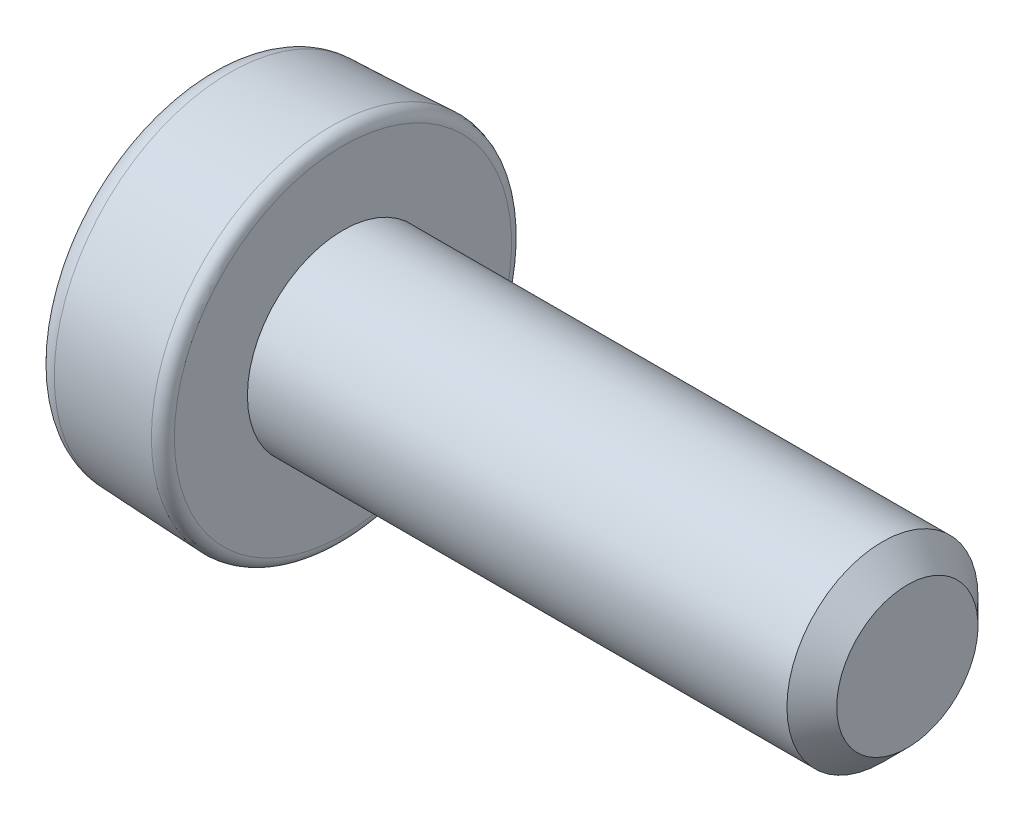
ISO-10303-21;
HEADER;
FILE_DESCRIPTION(('STEP AP214'),'2;1');
FILE_NAME('part.step','',(''),(''),'','','');
FILE_SCHEMA(('AUTOMOTIVE_DESIGN { 1 0 10303 214 1 1 1 1 }'));
ENDSEC;
DATA;
#1=APPLICATION_CONTEXT('core data for automotive mechanical design processes');
#2=APPLICATION_PROTOCOL_DEFINITION('international standard','automotive_design',2000,#1);
#3=PRODUCT_CONTEXT('',#1,'mechanical');
#4=PRODUCT('Part','Part','',(#3));
#5=PRODUCT_RELATED_PRODUCT_CATEGORY('part','',(#4));
#6=PRODUCT_DEFINITION_FORMATION('','',#4);
#7=PRODUCT_DEFINITION_CONTEXT('part definition',#1,'design');
#8=PRODUCT_DEFINITION('design','',#6,#7);
#9=PRODUCT_DEFINITION_SHAPE('','',#8);
#10=(LENGTH_UNIT() NAMED_UNIT(*) SI_UNIT(.MILLI.,.METRE.));
#11=(NAMED_UNIT(*) PLANE_ANGLE_UNIT() SI_UNIT($,.RADIAN.));
#12=(NAMED_UNIT(*) SI_UNIT($,.STERADIAN.) SOLID_ANGLE_UNIT());
#13=UNCERTAINTY_MEASURE_WITH_UNIT(LENGTH_MEASURE(1.E-05),#10,'distance_accuracy_value','');
#14=(GEOMETRIC_REPRESENTATION_CONTEXT(3) GLOBAL_UNCERTAINTY_ASSIGNED_CONTEXT((#13)) GLOBAL_UNIT_ASSIGNED_CONTEXT((#10,
#11,#12)) REPRESENTATION_CONTEXT('',''));
#15=CARTESIAN_POINT('',(0.,0.,0.));
#16=DIRECTION('',(0.,0.,1.));
#17=DIRECTION('',(1.,0.,0.));
#18=AXIS2_PLACEMENT_3D('',#15,#16,#17);
#19=CARTESIAN_POINT('',(-1.2,1.35943108259077,0.));
#20=DIRECTION('',(1.,0.,0.));
#21=DIRECTION('',(0.,0.,-1.));
#22=AXIS2_PLACEMENT_3D('',#19,#20,#21);
#23=PLANE('',#22);
#24=DIRECTION('',(0.,0.,-1.));
#25=VECTOR('',#24,1.);
#26=CARTESIAN_POINT('',(-1.2,0.15,0.));
#27=LINE('',#26,#25);
#28=CARTESIAN_POINT('',(-1.2,0.149999999999999,-0.35));
#29=VERTEX_POINT('',#28);
#30=CARTESIAN_POINT('',(-1.2,0.149999999999997,-0.8));
#31=VERTEX_POINT('',#30);
#32=EDGE_CURVE('E203',#29,#31,#27,.T.);
#33=ORIENTED_EDGE('',*,*,#32,.F.);
#34=DIRECTION('',(0.,-0.707106781186551,-0.707106781186544));
#35=VECTOR('',#34,1.);
#36=CARTESIAN_POINT('',(-1.2,0.35,-0.15));
#37=LINE('',#36,#35);
#38=CARTESIAN_POINT('',(-1.2,0.35,-0.15));
#39=VERTEX_POINT('',#38);
#40=EDGE_CURVE('E266',#29,#39,#37,.F.);
#41=ORIENTED_EDGE('',*,*,#40,.T.);
#42=DIRECTION('',(0.,-1.,0.));
#43=VECTOR('',#42,1.);
#44=CARTESIAN_POINT('',(-1.2,0.,-0.15));
#45=LINE('',#44,#43);
#46=CARTESIAN_POINT('',(-1.2,0.8,-0.15));
#47=VERTEX_POINT('',#46);
#48=EDGE_CURVE('E211',#47,#39,#45,.T.);
#49=ORIENTED_EDGE('',*,*,#48,.F.);
#50=DIRECTION('',(0.,0.,-1.));
#51=VECTOR('',#50,1.);
#52=CARTESIAN_POINT('',(-1.2,0.8,-0.15));
#53=LINE('',#52,#51);
#54=CARTESIAN_POINT('',(-1.2,0.8,0.15));
#55=VERTEX_POINT('',#54);
#56=EDGE_CURVE('E218',#55,#47,#53,.T.);
#57=ORIENTED_EDGE('',*,*,#56,.F.);
#58=DIRECTION('',(0.,1.,0.));
#59=VECTOR('',#58,1.);
#60=CARTESIAN_POINT('',(-1.2,0.,0.15));
#61=LINE('',#60,#59);
#62=CARTESIAN_POINT('',(-1.2,0.349999999999999,0.15));
#63=VERTEX_POINT('',#62);
#64=EDGE_CURVE('E226',#63,#55,#61,.T.);
#65=ORIENTED_EDGE('',*,*,#64,.F.);
#66=DIRECTION('',(0.,0.707106781186543,-0.707106781186552));
#67=VECTOR('',#66,1.);
#68=CARTESIAN_POINT('',(-1.2,0.349999999999999,0.15));
#69=LINE('',#68,#67);
#70=CARTESIAN_POINT('',(-1.2,0.150000000000001,0.35));
#71=VERTEX_POINT('',#70);
#72=EDGE_CURVE('E262',#63,#71,#69,.F.);
#73=ORIENTED_EDGE('',*,*,#72,.T.);
#74=CARTESIAN_POINT('',(-1.2,0.150000000000008,0.799999999999998));
#75=VERTEX_POINT('',#74);
#76=EDGE_CURVE('E204',#75,#71,#27,.T.);
#77=ORIENTED_EDGE('',*,*,#76,.F.);
#78=DIRECTION('',(0.,1.,0.));
#79=VECTOR('',#78,1.);
#80=CARTESIAN_POINT('',(-1.2,0.150000000000008,0.799999999999998));
#81=LINE('',#80,#79);
#82=CARTESIAN_POINT('',(-1.2,-0.149999999999992,0.800000000000001));
#83=VERTEX_POINT('',#82);
#84=EDGE_CURVE('E150',#83,#75,#81,.T.);
#85=ORIENTED_EDGE('',*,*,#84,.F.);
#86=DIRECTION('',(0.,0.,1.));
#87=VECTOR('',#86,1.);
#88=CARTESIAN_POINT('',(-1.2,-0.15,0.));
#89=LINE('',#88,#87);
#90=CARTESIAN_POINT('',(-1.2,-0.149999999999996,0.350000000000003));
#91=VERTEX_POINT('',#90);
#92=EDGE_CURVE('E156',#91,#83,#89,.T.);
#93=ORIENTED_EDGE('',*,*,#92,.F.);
#94=DIRECTION('',(0.,0.707106781186554,0.707106781186541));
#95=VECTOR('',#94,1.);
#96=CARTESIAN_POINT('',(-1.2,-0.35,0.150000000000002));
#97=LINE('',#96,#95);
#98=CARTESIAN_POINT('',(-1.2,-0.35,0.150000000000002));
#99=VERTEX_POINT('',#98);
#100=EDGE_CURVE('E260',#91,#99,#97,.F.);
#101=ORIENTED_EDGE('',*,*,#100,.T.);
#102=DIRECTION('',(0.,1.,0.));
#103=VECTOR('',#102,1.);
#104=CARTESIAN_POINT('',(-1.2,0.,0.15));
#105=LINE('',#104,#103);
#106=CARTESIAN_POINT('',(-1.2,-0.799999999999999,0.150000000000006));
#107=VERTEX_POINT('',#106);
#108=EDGE_CURVE('E168',#107,#99,#105,.T.);
#109=ORIENTED_EDGE('',*,*,#108,.F.);
#110=DIRECTION('',(0.,0.,1.));
#111=VECTOR('',#110,1.);
#112=CARTESIAN_POINT('',(-1.2,-0.799999999999999,0.150000000000006));
#113=LINE('',#112,#111);
#114=CARTESIAN_POINT('',(-1.2,-0.800000000000001,-0.149999999999994));
#115=VERTEX_POINT('',#114);
#116=EDGE_CURVE('E173',#115,#107,#113,.T.);
#117=ORIENTED_EDGE('',*,*,#116,.F.);
#118=DIRECTION('',(0.,-1.,0.));
#119=VECTOR('',#118,1.);
#120=CARTESIAN_POINT('',(-1.2,0.,-0.15));
#121=LINE('',#120,#119);
#122=CARTESIAN_POINT('',(-1.2,-0.350000000000002,-0.149999999999998));
#123=VERTEX_POINT('',#122);
#124=EDGE_CURVE('E181',#123,#115,#121,.T.);
#125=ORIENTED_EDGE('',*,*,#124,.F.);
#126=DIRECTION('',(0.,-0.707106781186545,0.70710678118655));
#127=VECTOR('',#126,1.);
#128=CARTESIAN_POINT('',(-1.2,-0.150000000000001,-0.35));
#129=LINE('',#128,#127);
#130=CARTESIAN_POINT('',(-1.2,-0.150000000000001,-0.35));
#131=VERTEX_POINT('',#130);
#132=EDGE_CURVE('E264',#123,#131,#129,.F.);
#133=ORIENTED_EDGE('',*,*,#132,.T.);
#134=DIRECTION('',(0.,0.,1.));
#135=VECTOR('',#134,1.);
#136=CARTESIAN_POINT('',(-1.2,-0.15,0.));
#137=LINE('',#136,#135);
#138=CARTESIAN_POINT('',(-1.2,-0.150000000000003,-0.799999999999999));
#139=VERTEX_POINT('',#138);
#140=EDGE_CURVE('E187',#139,#131,#137,.T.);
#141=ORIENTED_EDGE('',*,*,#140,.F.);
#142=DIRECTION('',(0.,-1.,0.));
#143=VECTOR('',#142,1.);
#144=CARTESIAN_POINT('',(-1.2,-0.150000000000003,-0.799999999999999));
#145=LINE('',#144,#143);
#146=EDGE_CURVE('E194',#31,#139,#145,.T.);
#147=ORIENTED_EDGE('',*,*,#146,.F.);
#148=EDGE_LOOP('',(#33,#41,#49,#57,#65,#73,#77,#85,#93,#101,#109,#117,#125,#133,#141,#147));
#149=FACE_BOUND('',#148,.T.);
#150=CARTESIAN_POINT('',(-1.2,0.,0.));
#151=DIRECTION('',(-1.,0.,0.));
#152=DIRECTION('',(0.,0.,1.));
#153=AXIS2_PLACEMENT_3D('',#150,#151,#152);
#154=CIRCLE('',#153,1.35943108259077);
#155=CARTESIAN_POINT('',(-1.2,0.,1.35943108259077));
#156=VERTEX_POINT('',#155);
#157=EDGE_CURVE('E252',#156,#156,#154,.T.);
#158=ORIENTED_EDGE('',*,*,#157,.T.);
#159=EDGE_LOOP('',(#158));
#160=FACE_BOUND('',#159,.T.);
#161=ADVANCED_FACE('F34',(#149,#160),#23,.F.);
#162=CARTESIAN_POINT('',(-1.,0.,0.));
#163=DIRECTION('',(-1.,0.,0.));
#164=DIRECTION('',(0.,0.,1.));
#165=AXIS2_PLACEMENT_3D('',#162,#163,#164);
#166=TOROIDAL_SURFACE('',#165,1.35943108259077,0.2);
#167=ORIENTED_EDGE('',*,*,#157,.F.);
#168=EDGE_LOOP('',(#167));
#169=FACE_BOUND('',#168,.T.);
#170=CARTESIAN_POINT('',(-1.00900614699517,0.,0.));
#171=DIRECTION('',(-1.,0.,0.));
#172=DIRECTION('',(0.,0.,1.));
#173=AXIS2_PLACEMENT_3D('',#170,#171,#172);
#174=CIRCLE('',#173,1.55922820298118);
#175=CARTESIAN_POINT('',(-1.00900614699517,0.,1.55922820298118));
#176=VERTEX_POINT('',#175);
#177=EDGE_CURVE('E249',#176,#176,#174,.T.);
#178=ORIENTED_EDGE('',*,*,#177,.T.);
#179=EDGE_LOOP('',(#178));
#180=FACE_BOUND('',#179,.T.);
#181=ADVANCED_FACE('F354',(#169,#180),#166,.T.);
#182=CARTESIAN_POINT('',(-0.104503073497586,0.,0.));
#183=DIRECTION('',(1.,0.,0.));
#184=DIRECTION('',(0.,0.,-1.));
#185=AXIS2_PLACEMENT_3D('',#182,#183,#184);
#186=CONICAL_SURFACE('',#185,1.6,0.0450459675199961);
#187=ORIENTED_EDGE('',*,*,#177,.F.);
#188=EDGE_LOOP('',(#187));
#189=FACE_BOUND('',#188,.T.);
#190=CARTESIAN_POINT('',(-0.104503073497586,0.,0.));
#191=DIRECTION('',(-1.,0.,0.));
#192=DIRECTION('',(0.,0.,1.));
#193=AXIS2_PLACEMENT_3D('',#190,#191,#192);
#194=CIRCLE('',#193,1.6);
#195=CARTESIAN_POINT('',(-0.104503073497586,0.,1.6));
#196=VERTEX_POINT('',#195);
#197=EDGE_CURVE('E246',#196,#196,#194,.T.);
#198=ORIENTED_EDGE('',*,*,#197,.T.);
#199=EDGE_LOOP('',(#198));
#200=FACE_BOUND('',#199,.T.);
#201=ADVANCED_FACE('F359',(#189,#200),#186,.T.);
#202=CARTESIAN_POINT('',(-0.1,0.,0.));
#203=DIRECTION('',(-1.,0.,0.));
#204=DIRECTION('',(0.,0.,1.));
#205=AXIS2_PLACEMENT_3D('',#202,#203,#204);
#206=TOROIDAL_SURFACE('',#205,1.50010143980479,0.1);
#207=ORIENTED_EDGE('',*,*,#197,.F.);
#208=EDGE_LOOP('',(#207));
#209=FACE_BOUND('',#208,.T.);
#210=CARTESIAN_POINT('',(0.,0.,0.));
#211=DIRECTION('',(-1.,0.,0.));
#212=DIRECTION('',(0.,0.,1.));
#213=AXIS2_PLACEMENT_3D('',#210,#211,#212);
#214=CIRCLE('',#213,1.50010143980479);
#215=CARTESIAN_POINT('',(0.,0.,1.50010143980479));
#216=VERTEX_POINT('',#215);
#217=EDGE_CURVE('E243',#216,#216,#214,.T.);
#218=ORIENTED_EDGE('',*,*,#217,.T.);
#219=EDGE_LOOP('',(#218));
#220=FACE_BOUND('',#219,.T.);
#221=ADVANCED_FACE('F532',(#209,#220),#206,.T.);
#222=CARTESIAN_POINT('',(0.,0.849999999999999,0.));
#223=DIRECTION('',(-1.,0.,0.));
#224=DIRECTION('',(0.,0.,1.));
#225=AXIS2_PLACEMENT_3D('',#222,#223,#224);
#226=PLANE('',#225);
#227=ORIENTED_EDGE('',*,*,#217,.F.);
#228=EDGE_LOOP('',(#227));
#229=FACE_BOUND('',#228,.T.);
#230=CARTESIAN_POINT('',(0.,0.,0.));
#231=DIRECTION('',(-1.,0.,0.));
#232=DIRECTION('',(0.,0.,1.));
#233=AXIS2_PLACEMENT_3D('',#230,#231,#232);
#234=CIRCLE('',#233,0.849999999999999);
#235=CARTESIAN_POINT('',(0.,0.,0.849999999999999));
#236=VERTEX_POINT('',#235);
#237=EDGE_CURVE('E240',#236,#236,#234,.T.);
#238=ORIENTED_EDGE('',*,*,#237,.T.);
#239=EDGE_LOOP('',(#238));
#240=FACE_BOUND('',#239,.T.);
#241=ADVANCED_FACE('F522',(#229,#240),#226,.F.);
#242=CARTESIAN_POINT('',(-2.78391866276236,0.,0.));
#243=DIRECTION('',(-1.,0.,0.));
#244=DIRECTION('',(0.,0.,1.));
#245=AXIS2_PLACEMENT_3D('',#242,#243,#244);
#246=CYLINDRICAL_SURFACE('',#245,0.85);
#247=ORIENTED_EDGE('',*,*,#237,.F.);
#248=EDGE_LOOP('',(#247));
#249=FACE_BOUND('',#248,.T.);
#250=CARTESIAN_POINT('',(4.8,0.,0.));
#251=DIRECTION('',(-1.,0.,0.));
#252=DIRECTION('',(0.,0.,1.));
#253=AXIS2_PLACEMENT_3D('',#250,#251,#252);
#254=CIRCLE('',#253,0.85);
#255=CARTESIAN_POINT('',(4.8,0.,0.85));
#256=VERTEX_POINT('',#255);
#257=EDGE_CURVE('E237',#256,#256,#254,.T.);
#258=ORIENTED_EDGE('',*,*,#257,.T.);
#259=EDGE_LOOP('',(#258));
#260=FACE_BOUND('',#259,.T.);
#261=ADVANCED_FACE('F512',(#249,#260),#246,.T.);
#262=CARTESIAN_POINT('',(5.02160747377912,0.,0.));
#263=DIRECTION('',(-1.,0.,0.));
#264=DIRECTION('',(0.,0.,1.));
#265=AXIS2_PLACEMENT_3D('',#262,#263,#264);
#266=CONICAL_SURFACE('',#265,0.628392526220876,0.785398163397451);
#267=ORIENTED_EDGE('',*,*,#257,.F.);
#268=EDGE_LOOP('',(#267));
#269=FACE_BOUND('',#268,.T.);
#270=CARTESIAN_POINT('',(5.02160747377912,0.,0.));
#271=DIRECTION('',(-1.,0.,0.));
#272=DIRECTION('',(0.,0.,1.));
#273=AXIS2_PLACEMENT_3D('',#270,#271,#272);
#274=CIRCLE('',#273,0.628392526220876);
#275=CARTESIAN_POINT('',(5.02160747377912,0.,0.628392526220876));
#276=VERTEX_POINT('',#275);
#277=EDGE_CURVE('E232',#276,#276,#274,.T.);
#278=ORIENTED_EDGE('',*,*,#277,.T.);
#279=EDGE_LOOP('',(#278));
#280=FACE_BOUND('',#279,.T.);
#281=ADVANCED_FACE('F502',(#269,#280),#266,.T.);
#282=CARTESIAN_POINT('',(5.02160747377912,0.,0.));
#283=DIRECTION('',(-1.,0.,0.));
#284=DIRECTION('',(0.,0.,1.));
#285=AXIS2_PLACEMENT_3D('',#282,#283,#284);
#286=PLANE('',#285);
#287=ORIENTED_EDGE('',*,*,#277,.F.);
#288=EDGE_LOOP('',(#287));
#289=FACE_BOUND('',#288,.T.);
#290=ADVANCED_FACE('F350',(#289),#286,.F.);
#291=CARTESIAN_POINT('',(-0.9,0.,-0.15));
#292=DIRECTION('',(0.,0.,-1.));
#293=DIRECTION('',(-1.,0.,0.));
#294=AXIS2_PLACEMENT_3D('',#291,#292,#293);
#295=PLANE('',#294);
#296=ORIENTED_EDGE('',*,*,#48,.T.);
#297=DIRECTION('',(1.,0.,0.));
#298=VECTOR('',#297,1.);
#299=CARTESIAN_POINT('',(-0.9,0.35,-0.15));
#300=LINE('',#299,#298);
#301=CARTESIAN_POINT('',(-0.9,0.35,-0.15));
#302=VERTEX_POINT('',#301);
#303=EDGE_CURVE('E255',#39,#302,#300,.T.);
#304=ORIENTED_EDGE('',*,*,#303,.T.);
#305=DIRECTION('',(0.,-1.,0.));
#306=VECTOR('',#305,1.);
#307=CARTESIAN_POINT('',(-0.9,0.,-0.15));
#308=LINE('',#307,#306);
#309=CARTESIAN_POINT('',(-0.9,0.8,-0.15));
#310=VERTEX_POINT('',#309);
#311=EDGE_CURVE('E214',#310,#302,#308,.T.);
#312=ORIENTED_EDGE('',*,*,#311,.F.);
#313=DIRECTION('',(-1.,0.,0.));
#314=VECTOR('',#313,1.);
#315=CARTESIAN_POINT('',(-0.9,0.8,-0.15));
#316=LINE('',#315,#314);
#317=EDGE_CURVE('E230',#310,#47,#316,.T.);
#318=ORIENTED_EDGE('',*,*,#317,.T.);
#319=EDGE_LOOP('',(#296,#304,#312,#318));
#320=FACE_BOUND('',#319,.T.);
#321=ADVANCED_FACE('F340',(#320),#295,.F.);
#322=CARTESIAN_POINT('',(-0.9,0.8,-0.15));
#323=DIRECTION('',(0.,1.,0.));
#324=DIRECTION('',(0.,0.,1.));
#325=AXIS2_PLACEMENT_3D('',#322,#323,#324);
#326=PLANE('',#325);
#327=ORIENTED_EDGE('',*,*,#56,.T.);
#328=ORIENTED_EDGE('',*,*,#317,.F.);
#329=DIRECTION('',(0.,0.,-1.));
#330=VECTOR('',#329,1.);
#331=CARTESIAN_POINT('',(-0.9,0.8,-0.15));
#332=LINE('',#331,#330);
#333=CARTESIAN_POINT('',(-0.9,0.8,0.15));
#334=VERTEX_POINT('',#333);
#335=EDGE_CURVE('E220',#334,#310,#332,.T.);
#336=ORIENTED_EDGE('',*,*,#335,.F.);
#337=DIRECTION('',(-1.,0.,0.));
#338=VECTOR('',#337,1.);
#339=CARTESIAN_POINT('',(-0.9,0.8,0.15));
#340=LINE('',#339,#338);
#341=EDGE_CURVE('E223',#334,#55,#340,.T.);
#342=ORIENTED_EDGE('',*,*,#341,.T.);
#343=EDGE_LOOP('',(#327,#328,#336,#342));
#344=FACE_BOUND('',#343,.T.);
#345=ADVANCED_FACE('F342',(#344),#326,.F.);
#346=CARTESIAN_POINT('',(-0.9,0.,0.15));
#347=DIRECTION('',(0.,0.,1.));
#348=DIRECTION('',(0.,-1.,0.));
#349=AXIS2_PLACEMENT_3D('',#346,#347,#348);
#350=PLANE('',#349);
#351=DIRECTION('',(0.,1.,0.));
#352=VECTOR('',#351,1.);
#353=CARTESIAN_POINT('',(-0.9,0.,0.15));
#354=LINE('',#353,#352);
#355=CARTESIAN_POINT('',(-0.9,0.349999999999999,0.15));
#356=VERTEX_POINT('',#355);
#357=EDGE_CURVE('E217',#356,#334,#354,.T.);
#358=ORIENTED_EDGE('',*,*,#357,.F.);
#359=DIRECTION('',(-1.,0.,0.));
#360=VECTOR('',#359,1.);
#361=CARTESIAN_POINT('',(-0.9,0.349999999999999,0.15));
#362=LINE('',#361,#360);
#363=EDGE_CURVE('E273',#356,#63,#362,.T.);
#364=ORIENTED_EDGE('',*,*,#363,.T.);
#365=ORIENTED_EDGE('',*,*,#64,.T.);
#366=ORIENTED_EDGE('',*,*,#341,.F.);
#367=EDGE_LOOP('',(#358,#364,#365,#366));
#368=FACE_BOUND('',#367,.T.);
#369=ADVANCED_FACE('F292',(#368),#350,.F.);
#370=CARTESIAN_POINT('',(-0.9,0.8,-0.15));
#371=DIRECTION('',(1.,0.,0.));
#372=DIRECTION('',(0.,0.,-1.));
#373=AXIS2_PLACEMENT_3D('',#370,#371,#372);
#374=PLANE('',#373);
#375=DIRECTION('',(0.,0.,-1.));
#376=VECTOR('',#375,1.);
#377=CARTESIAN_POINT('',(-0.9,0.15,0.));
#378=LINE('',#377,#376);
#379=CARTESIAN_POINT('',(-0.9,0.150000000000008,0.799999999999998));
#380=VERTEX_POINT('',#379);
#381=CARTESIAN_POINT('',(-0.9,0.150000000000001,0.35));
#382=VERTEX_POINT('',#381);
#383=EDGE_CURVE('E195',#380,#382,#378,.T.);
#384=ORIENTED_EDGE('',*,*,#383,.T.);
#385=DIRECTION('',(0.,-0.707106781186543,0.707106781186552));
#386=VECTOR('',#385,1.);
#387=CARTESIAN_POINT('',(-0.9,0.724999999999997,-0.225000000000002));
#388=LINE('',#387,#386);
#389=EDGE_CURVE('E42',#382,#356,#388,.F.);
#390=ORIENTED_EDGE('',*,*,#389,.T.);
#391=ORIENTED_EDGE('',*,*,#357,.T.);
#392=ORIENTED_EDGE('',*,*,#335,.T.);
#393=ORIENTED_EDGE('',*,*,#311,.T.);
#394=DIRECTION('',(0.,0.707106781186551,0.707106781186544));
#395=VECTOR('',#394,1.);
#396=CARTESIAN_POINT('',(-0.9,0.575000000000002,0.0749999999999999));
#397=LINE('',#396,#395);
#398=CARTESIAN_POINT('',(-0.9,0.149999999999999,-0.35));
#399=VERTEX_POINT('',#398);
#400=EDGE_CURVE('E282',#302,#399,#397,.F.);
#401=ORIENTED_EDGE('',*,*,#400,.T.);
#402=CARTESIAN_POINT('',(-0.9,0.149999999999997,-0.8));
#403=VERTEX_POINT('',#402);
#404=EDGE_CURVE('E193',#399,#403,#378,.T.);
#405=ORIENTED_EDGE('',*,*,#404,.T.);
#406=DIRECTION('',(0.,-1.,0.));
#407=VECTOR('',#406,1.);
#408=CARTESIAN_POINT('',(-0.9,-0.150000000000003,-0.799999999999999));
#409=LINE('',#408,#407);
#410=CARTESIAN_POINT('',(-0.9,-0.150000000000003,-0.799999999999999));
#411=VERTEX_POINT('',#410);
#412=EDGE_CURVE('E197',#403,#411,#409,.T.);
#413=ORIENTED_EDGE('',*,*,#412,.T.);
#414=DIRECTION('',(0.,0.,1.));
#415=VECTOR('',#414,1.);
#416=CARTESIAN_POINT('',(-0.9,-0.15,0.));
#417=LINE('',#416,#415);
#418=CARTESIAN_POINT('',(-0.9,-0.150000000000001,-0.35));
#419=VERTEX_POINT('',#418);
#420=EDGE_CURVE('E190',#411,#419,#417,.T.);
#421=ORIENTED_EDGE('',*,*,#420,.T.);
#422=DIRECTION('',(0.,0.707106781186545,-0.70710678118655));
#423=VECTOR('',#422,1.);
#424=CARTESIAN_POINT('',(-0.9,0.224999999999996,-0.725));
#425=LINE('',#424,#423);
#426=CARTESIAN_POINT('',(-0.9,-0.350000000000002,-0.149999999999998));
#427=VERTEX_POINT('',#426);
#428=EDGE_CURVE('E284',#419,#427,#425,.F.);
#429=ORIENTED_EDGE('',*,*,#428,.T.);
#430=DIRECTION('',(0.,-1.,0.));
#431=VECTOR('',#430,1.);
#432=CARTESIAN_POINT('',(-0.9,0.,-0.15));
#433=LINE('',#432,#431);
#434=CARTESIAN_POINT('',(-0.9,-0.800000000000001,-0.149999999999994));
#435=VERTEX_POINT('',#434);
#436=EDGE_CURVE('E172',#427,#435,#433,.T.);
#437=ORIENTED_EDGE('',*,*,#436,.T.);
#438=DIRECTION('',(0.,0.,1.));
#439=VECTOR('',#438,1.);
#440=CARTESIAN_POINT('',(-0.9,-0.799999999999999,0.150000000000006));
#441=LINE('',#440,#439);
#442=CARTESIAN_POINT('',(-0.9,-0.799999999999999,0.150000000000006));
#443=VERTEX_POINT('',#442);
#444=EDGE_CURVE('E175',#435,#443,#441,.T.);
#445=ORIENTED_EDGE('',*,*,#444,.T.);
#446=DIRECTION('',(0.,1.,0.));
#447=VECTOR('',#446,1.);
#448=CARTESIAN_POINT('',(-0.9,0.,0.15));
#449=LINE('',#448,#447);
#450=CARTESIAN_POINT('',(-0.9,-0.35,0.150000000000002));
#451=VERTEX_POINT('',#450);
#452=EDGE_CURVE('E170',#443,#451,#449,.T.);
#453=ORIENTED_EDGE('',*,*,#452,.T.);
#454=DIRECTION('',(0.,-0.707106781186554,-0.707106781186541));
#455=VECTOR('',#454,1.);
#456=CARTESIAN_POINT('',(-0.9,0.0750000000000085,0.575000000000004));
#457=LINE('',#456,#455);
#458=CARTESIAN_POINT('',(-0.9,-0.149999999999996,0.350000000000003));
#459=VERTEX_POINT('',#458);
#460=EDGE_CURVE('E11',#451,#459,#457,.F.);
#461=ORIENTED_EDGE('',*,*,#460,.T.);
#462=DIRECTION('',(0.,0.,1.));
#463=VECTOR('',#462,1.);
#464=CARTESIAN_POINT('',(-0.9,-0.15,0.));
#465=LINE('',#464,#463);
#466=CARTESIAN_POINT('',(-0.9,-0.149999999999992,0.800000000000001));
#467=VERTEX_POINT('',#466);
#468=EDGE_CURVE('E143',#459,#467,#465,.T.);
#469=ORIENTED_EDGE('',*,*,#468,.T.);
#470=DIRECTION('',(0.,1.,0.));
#471=VECTOR('',#470,1.);
#472=CARTESIAN_POINT('',(-0.9,0.150000000000008,0.799999999999998));
#473=LINE('',#472,#471);
#474=EDGE_CURVE('E148',#467,#380,#473,.T.);
#475=ORIENTED_EDGE('',*,*,#474,.T.);
#476=EDGE_LOOP('',(#384,#390,#391,#392,#393,#401,#405,#413,#421,#429,#437,#445,#453,#461,#469,#475));
#477=FACE_BOUND('',#476,.T.);
#478=ADVANCED_FACE('F146',(#477),#374,.F.);
#479=CARTESIAN_POINT('',(-0.9,0.15,0.));
#480=DIRECTION('',(0.,1.,0.));
#481=DIRECTION('',(0.,0.,1.));
#482=AXIS2_PLACEMENT_3D('',#479,#480,#481);
#483=PLANE('',#482);
#484=ORIENTED_EDGE('',*,*,#404,.F.);
#485=DIRECTION('',(-1.,0.,0.));
#486=VECTOR('',#485,1.);
#487=CARTESIAN_POINT('',(-0.9,0.149999999999999,-0.35));
#488=LINE('',#487,#486);
#489=EDGE_CURVE('E258',#399,#29,#488,.T.);
#490=ORIENTED_EDGE('',*,*,#489,.T.);
#491=ORIENTED_EDGE('',*,*,#32,.T.);
#492=DIRECTION('',(-1.,0.,0.));
#493=VECTOR('',#492,1.);
#494=CARTESIAN_POINT('',(-0.9,0.149999999999997,-0.8));
#495=LINE('',#494,#493);
#496=EDGE_CURVE('E200',#403,#31,#495,.T.);
#497=ORIENTED_EDGE('',*,*,#496,.F.);
#498=EDGE_LOOP('',(#484,#490,#491,#497));
#499=FACE_BOUND('',#498,.T.);
#500=ADVANCED_FACE('F437',(#499),#483,.F.);
#501=ORIENTED_EDGE('',*,*,#76,.T.);
#502=DIRECTION('',(1.,0.,0.));
#503=VECTOR('',#502,1.);
#504=CARTESIAN_POINT('',(-0.9,0.150000000000001,0.35));
#505=LINE('',#504,#503);
#506=EDGE_CURVE('E276',#71,#382,#505,.T.);
#507=ORIENTED_EDGE('',*,*,#506,.T.);
#508=ORIENTED_EDGE('',*,*,#383,.F.);
#509=DIRECTION('',(-1.,0.,0.));
#510=VECTOR('',#509,1.);
#511=CARTESIAN_POINT('',(-0.9,0.150000000000008,0.799999999999998));
#512=LINE('',#511,#510);
#513=EDGE_CURVE('E160',#380,#75,#512,.T.);
#514=ORIENTED_EDGE('',*,*,#513,.T.);
#515=EDGE_LOOP('',(#501,#507,#508,#514));
#516=FACE_BOUND('',#515,.T.);
#517=ADVANCED_FACE('F302',(#516),#483,.F.);
#518=CARTESIAN_POINT('',(-0.9,-0.15,0.));
#519=DIRECTION('',(0.,-1.,0.));
#520=DIRECTION('',(0.,0.,-1.));
#521=AXIS2_PLACEMENT_3D('',#518,#519,#520);
#522=PLANE('',#521);
#523=ORIENTED_EDGE('',*,*,#140,.T.);
#524=DIRECTION('',(1.,0.,0.));
#525=VECTOR('',#524,1.);
#526=CARTESIAN_POINT('',(-0.9,-0.150000000000001,-0.35));
#527=LINE('',#526,#525);
#528=EDGE_CURVE('E268',#131,#419,#527,.T.);
#529=ORIENTED_EDGE('',*,*,#528,.T.);
#530=ORIENTED_EDGE('',*,*,#420,.F.);
#531=DIRECTION('',(-1.,0.,0.));
#532=VECTOR('',#531,1.);
#533=CARTESIAN_POINT('',(-0.9,-0.150000000000003,-0.799999999999999));
#534=LINE('',#533,#532);
#535=EDGE_CURVE('E209',#411,#139,#534,.T.);
#536=ORIENTED_EDGE('',*,*,#535,.T.);
#537=EDGE_LOOP('',(#523,#529,#530,#536));
#538=FACE_BOUND('',#537,.T.);
#539=ADVANCED_FACE('F324',(#538),#522,.F.);
#540=CARTESIAN_POINT('',(-0.9,-0.150000000000003,-0.799999999999999));
#541=DIRECTION('',(0.,0.,-1.));
#542=DIRECTION('',(0.,1.,0.));
#543=AXIS2_PLACEMENT_3D('',#540,#541,#542);
#544=PLANE('',#543);
#545=ORIENTED_EDGE('',*,*,#146,.T.);
#546=ORIENTED_EDGE('',*,*,#535,.F.);
#547=ORIENTED_EDGE('',*,*,#412,.F.);
#548=ORIENTED_EDGE('',*,*,#496,.T.);
#549=EDGE_LOOP('',(#545,#546,#547,#548));
#550=FACE_BOUND('',#549,.T.);
#551=ADVANCED_FACE('F329',(#550),#544,.F.);
#552=CARTESIAN_POINT('',(-0.9,0.,0.15));
#553=DIRECTION('',(0.,0.,1.));
#554=DIRECTION('',(0.,-1.,0.));
#555=AXIS2_PLACEMENT_3D('',#552,#553,#554);
#556=PLANE('',#555);
#557=ORIENTED_EDGE('',*,*,#108,.T.);
#558=DIRECTION('',(1.,0.,0.));
#559=VECTOR('',#558,1.);
#560=CARTESIAN_POINT('',(-0.9,-0.35,0.150000000000002));
#561=LINE('',#560,#559);
#562=EDGE_CURVE('E278',#99,#451,#561,.T.);
#563=ORIENTED_EDGE('',*,*,#562,.T.);
#564=ORIENTED_EDGE('',*,*,#452,.F.);
#565=DIRECTION('',(-1.,0.,0.));
#566=VECTOR('',#565,1.);
#567=CARTESIAN_POINT('',(-0.9,-0.799999999999999,0.150000000000006));
#568=LINE('',#567,#566);
#569=EDGE_CURVE('E185',#443,#107,#568,.T.);
#570=ORIENTED_EDGE('',*,*,#569,.T.);
#571=EDGE_LOOP('',(#557,#563,#564,#570));
#572=FACE_BOUND('',#571,.T.);
#573=ADVANCED_FACE('F307',(#572),#556,.F.);
#574=CARTESIAN_POINT('',(-0.9,-0.799999999999999,0.150000000000006));
#575=DIRECTION('',(0.,-1.,0.));
#576=DIRECTION('',(0.,0.,-1.));
#577=AXIS2_PLACEMENT_3D('',#574,#575,#576);
#578=PLANE('',#577);
#579=ORIENTED_EDGE('',*,*,#116,.T.);
#580=ORIENTED_EDGE('',*,*,#569,.F.);
#581=ORIENTED_EDGE('',*,*,#444,.F.);
#582=DIRECTION('',(-1.,0.,0.));
#583=VECTOR('',#582,1.);
#584=CARTESIAN_POINT('',(-0.9,-0.800000000000001,-0.149999999999994));
#585=LINE('',#584,#583);
#586=EDGE_CURVE('E178',#435,#115,#585,.T.);
#587=ORIENTED_EDGE('',*,*,#586,.T.);
#588=EDGE_LOOP('',(#579,#580,#581,#587));
#589=FACE_BOUND('',#588,.T.);
#590=ADVANCED_FACE('F312',(#589),#578,.F.);
#591=CARTESIAN_POINT('',(-0.9,0.,-0.15));
#592=DIRECTION('',(0.,0.,-1.));
#593=DIRECTION('',(0.,1.,0.));
#594=AXIS2_PLACEMENT_3D('',#591,#592,#593);
#595=PLANE('',#594);
#596=ORIENTED_EDGE('',*,*,#436,.F.);
#597=DIRECTION('',(-1.,0.,0.));
#598=VECTOR('',#597,1.);
#599=CARTESIAN_POINT('',(-0.9,-0.350000000000002,-0.149999999999998));
#600=LINE('',#599,#598);
#601=EDGE_CURVE('E271',#427,#123,#600,.T.);
#602=ORIENTED_EDGE('',*,*,#601,.T.);
#603=ORIENTED_EDGE('',*,*,#124,.T.);
#604=ORIENTED_EDGE('',*,*,#586,.F.);
#605=EDGE_LOOP('',(#596,#602,#603,#604));
#606=FACE_BOUND('',#605,.T.);
#607=ADVANCED_FACE('F404',(#606),#595,.F.);
#608=CARTESIAN_POINT('',(-0.9,0.150000000000008,0.799999999999998));
#609=DIRECTION('',(0.,0.,1.));
#610=DIRECTION('',(0.,-1.,0.));
#611=AXIS2_PLACEMENT_3D('',#608,#609,#610);
#612=PLANE('',#611);
#613=ORIENTED_EDGE('',*,*,#84,.T.);
#614=ORIENTED_EDGE('',*,*,#513,.F.);
#615=ORIENTED_EDGE('',*,*,#474,.F.);
#616=DIRECTION('',(-1.,0.,0.));
#617=VECTOR('',#616,1.);
#618=CARTESIAN_POINT('',(-0.9,-0.149999999999992,0.800000000000001));
#619=LINE('',#618,#617);
#620=EDGE_CURVE('E153',#467,#83,#619,.T.);
#621=ORIENTED_EDGE('',*,*,#620,.T.);
#622=EDGE_LOOP('',(#613,#614,#615,#621));
#623=FACE_BOUND('',#622,.T.);
#624=ADVANCED_FACE('F163',(#623),#612,.F.);
#625=CARTESIAN_POINT('',(-0.9,-0.15,0.));
#626=DIRECTION('',(0.,-1.,0.));
#627=DIRECTION('',(0.,0.,-1.));
#628=AXIS2_PLACEMENT_3D('',#625,#626,#627);
#629=PLANE('',#628);
#630=ORIENTED_EDGE('',*,*,#468,.F.);
#631=DIRECTION('',(-1.,0.,0.));
#632=VECTOR('',#631,1.);
#633=CARTESIAN_POINT('',(-0.9,-0.149999999999996,0.350000000000003));
#634=LINE('',#633,#632);
#635=EDGE_CURVE('E280',#459,#91,#634,.T.);
#636=ORIENTED_EDGE('',*,*,#635,.T.);
#637=ORIENTED_EDGE('',*,*,#92,.T.);
#638=ORIENTED_EDGE('',*,*,#620,.F.);
#639=EDGE_LOOP('',(#630,#636,#637,#638));
#640=FACE_BOUND('',#639,.T.);
#641=ADVANCED_FACE('F154',(#640),#629,.F.);
#642=CARTESIAN_POINT('',(-0.9,0.35,-0.15));
#643=DIRECTION('',(0.,0.707106781186544,-0.707106781186551));
#644=DIRECTION('',(0.,0.707106781186551,0.707106781186544));
#645=AXIS2_PLACEMENT_3D('',#642,#643,#644);
#646=PLANE('',#645);
#647=ORIENTED_EDGE('',*,*,#40,.F.);
#648=ORIENTED_EDGE('',*,*,#489,.F.);
#649=ORIENTED_EDGE('',*,*,#400,.F.);
#650=ORIENTED_EDGE('',*,*,#303,.F.);
#651=EDGE_LOOP('',(#647,#648,#649,#650));
#652=FACE_BOUND('',#651,.T.);
#653=ADVANCED_FACE('F337',(#652),#646,.F.);
#654=CARTESIAN_POINT('',(-0.9,-0.150000000000001,-0.35));
#655=DIRECTION('',(0.,-0.70710678118655,-0.707106781186545));
#656=DIRECTION('',(0.,0.707106781186545,-0.70710678118655));
#657=AXIS2_PLACEMENT_3D('',#654,#655,#656);
#658=PLANE('',#657);
#659=ORIENTED_EDGE('',*,*,#132,.F.);
#660=ORIENTED_EDGE('',*,*,#601,.F.);
#661=ORIENTED_EDGE('',*,*,#428,.F.);
#662=ORIENTED_EDGE('',*,*,#528,.F.);
#663=EDGE_LOOP('',(#659,#660,#661,#662));
#664=FACE_BOUND('',#663,.T.);
#665=ADVANCED_FACE('F321',(#664),#658,.F.);
#666=CARTESIAN_POINT('',(-0.9,0.349999999999999,0.15));
#667=DIRECTION('',(0.,0.707106781186552,0.707106781186543));
#668=DIRECTION('',(0.,-0.707106781186543,0.707106781186552));
#669=AXIS2_PLACEMENT_3D('',#666,#667,#668);
#670=PLANE('',#669);
#671=ORIENTED_EDGE('',*,*,#389,.F.);
#672=ORIENTED_EDGE('',*,*,#506,.F.);
#673=ORIENTED_EDGE('',*,*,#72,.F.);
#674=ORIENTED_EDGE('',*,*,#363,.F.);
#675=EDGE_LOOP('',(#671,#672,#673,#674));
#676=FACE_BOUND('',#675,.T.);
#677=ADVANCED_FACE('F295',(#676),#670,.F.);
#678=CARTESIAN_POINT('',(-0.9,-0.35,0.150000000000002));
#679=DIRECTION('',(0.,-0.707106781186541,0.707106781186554));
#680=DIRECTION('',(0.,-0.707106781186554,-0.707106781186541));
#681=AXIS2_PLACEMENT_3D('',#678,#679,#680);
#682=PLANE('',#681);
#683=ORIENTED_EDGE('',*,*,#100,.F.);
#684=ORIENTED_EDGE('',*,*,#635,.F.);
#685=ORIENTED_EDGE('',*,*,#460,.F.);
#686=ORIENTED_EDGE('',*,*,#562,.F.);
#687=EDGE_LOOP('',(#683,#684,#685,#686));
#688=FACE_BOUND('',#687,.T.);
#689=ADVANCED_FACE('F36',(#688),#682,.F.);
#690=CLOSED_SHELL('',(#161,#181,#201,#221,#241,#261,#281,#290,#321,#345,#369,#478,#500,#517,
#539,#551,#573,#590,#607,#624,#641,#653,#665,#677,#689));
#691=MANIFOLD_SOLID_BREP('B2',#690);
#692=ADVANCED_BREP_SHAPE_REPRESENTATION('',(#18,#691),#14);
#693=SHAPE_DEFINITION_REPRESENTATION(#9,#692);
ENDSEC;
END-ISO-10303-21;
